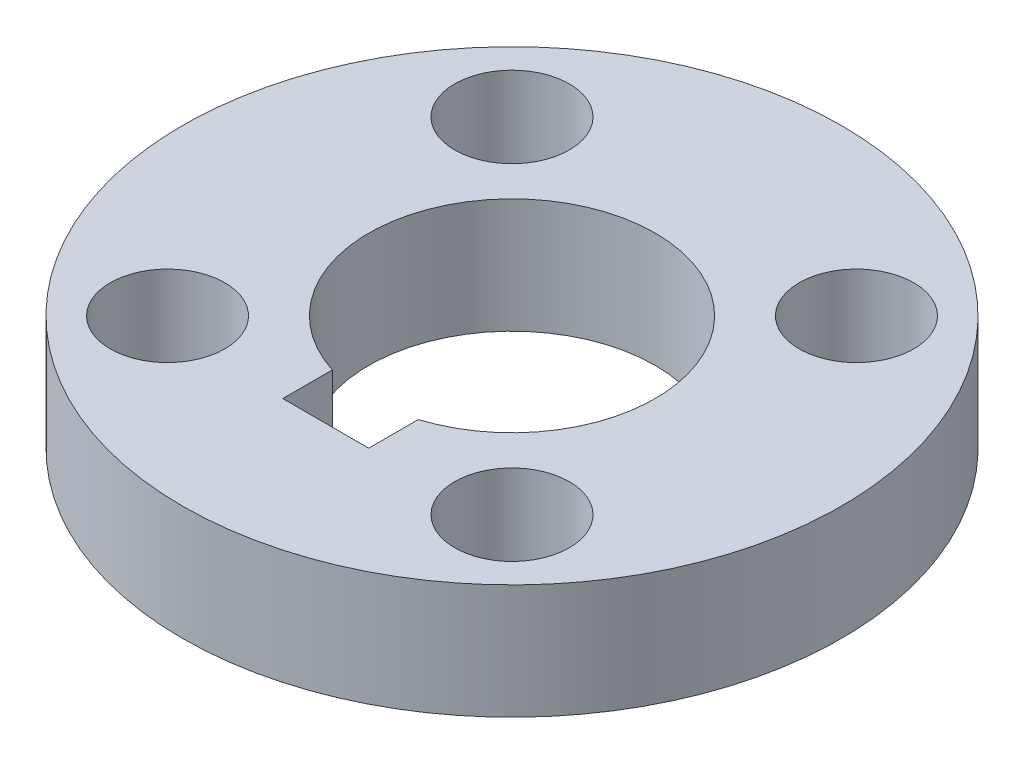
ISO-10303-21;
HEADER;
FILE_DESCRIPTION(('STEP AP214'),'2;1');
FILE_NAME('part.step','',(''),(''),'','','');
FILE_SCHEMA(('AUTOMOTIVE_DESIGN { 1 0 10303 214 1 1 1 1 }'));
ENDSEC;
DATA;
#1=APPLICATION_CONTEXT('core data for automotive mechanical design processes');
#2=APPLICATION_PROTOCOL_DEFINITION('international standard','automotive_design',2000,#1);
#3=PRODUCT_CONTEXT('',#1,'mechanical');
#4=PRODUCT('Part','Part','',(#3));
#5=PRODUCT_RELATED_PRODUCT_CATEGORY('part','',(#4));
#6=PRODUCT_DEFINITION_FORMATION('','',#4);
#7=PRODUCT_DEFINITION_CONTEXT('part definition',#1,'design');
#8=PRODUCT_DEFINITION('design','',#6,#7);
#9=PRODUCT_DEFINITION_SHAPE('','',#8);
#10=(LENGTH_UNIT() NAMED_UNIT(*) SI_UNIT(.MILLI.,.METRE.));
#11=(NAMED_UNIT(*) PLANE_ANGLE_UNIT() SI_UNIT($,.RADIAN.));
#12=(NAMED_UNIT(*) SI_UNIT($,.STERADIAN.) SOLID_ANGLE_UNIT());
#13=UNCERTAINTY_MEASURE_WITH_UNIT(LENGTH_MEASURE(1.E-05),#10,'distance_accuracy_value','');
#14=(GEOMETRIC_REPRESENTATION_CONTEXT(3) GLOBAL_UNCERTAINTY_ASSIGNED_CONTEXT((#13)) GLOBAL_UNIT_ASSIGNED_CONTEXT((#10,
#11,#12)) REPRESENTATION_CONTEXT('',''));
#15=CARTESIAN_POINT('',(0.,0.,0.));
#16=DIRECTION('',(0.,0.,1.));
#17=DIRECTION('',(1.,0.,0.));
#18=AXIS2_PLACEMENT_3D('',#15,#16,#17);
#19=CARTESIAN_POINT('',(0.,8.,0.));
#20=DIRECTION('',(0.,1.,0.));
#21=DIRECTION('',(0.,0.,1.));
#22=AXIS2_PLACEMENT_3D('',#19,#20,#21);
#23=PLANE('',#22);
#24=CARTESIAN_POINT('',(12.0208152801712,8.,-12.0208152801714));
#25=DIRECTION('',(0.,-1.,0.));
#26=DIRECTION('',(-1.,0.,0.));
#27=AXIS2_PLACEMENT_3D('',#24,#25,#26);
#28=CIRCLE('',#27,4.);
#29=CARTESIAN_POINT('',(8.02081528017121,8.,-12.0208152801714));
#30=VERTEX_POINT('',#29);
#31=EDGE_CURVE('E169',#30,#30,#28,.T.);
#32=ORIENTED_EDGE('',*,*,#31,.T.);
#33=EDGE_LOOP('',(#32));
#34=FACE_BOUND('',#33,.T.);
#35=CARTESIAN_POINT('',(-12.0208152801714,8.,-12.0208152801712));
#36=DIRECTION('',(0.,-1.,0.));
#37=DIRECTION('',(0.,0.,1.));
#38=AXIS2_PLACEMENT_3D('',#35,#36,#37);
#39=CIRCLE('',#38,4.);
#40=CARTESIAN_POINT('',(-12.0208152801714,8.,-8.02081528017125));
#41=VERTEX_POINT('',#40);
#42=EDGE_CURVE('E173',#41,#41,#39,.T.);
#43=ORIENTED_EDGE('',*,*,#42,.T.);
#44=EDGE_LOOP('',(#43));
#45=FACE_BOUND('',#44,.T.);
#46=CARTESIAN_POINT('',(-12.0208152801711,8.,12.0208152801715));
#47=DIRECTION('',(0.,-1.,0.));
#48=DIRECTION('',(1.,0.,0.));
#49=AXIS2_PLACEMENT_3D('',#46,#47,#48);
#50=CIRCLE('',#49,4.);
#51=CARTESIAN_POINT('',(-8.02081528017112,8.,12.0208152801715));
#52=VERTEX_POINT('',#51);
#53=EDGE_CURVE('E183',#52,#52,#50,.T.);
#54=ORIENTED_EDGE('',*,*,#53,.T.);
#55=EDGE_LOOP('',(#54));
#56=FACE_BOUND('',#55,.T.);
#57=CARTESIAN_POINT('',(12.0208152801714,8.,12.0208152801712));
#58=DIRECTION('',(0.,-1.,0.));
#59=DIRECTION('',(0.,0.,-1.));
#60=AXIS2_PLACEMENT_3D('',#57,#58,#59);
#61=CIRCLE('',#60,4.);
#62=CARTESIAN_POINT('',(12.0208152801714,8.,8.02081528017125));
#63=VERTEX_POINT('',#62);
#64=EDGE_CURVE('E82',#63,#63,#61,.T.);
#65=ORIENTED_EDGE('',*,*,#64,.T.);
#66=EDGE_LOOP('',(#65));
#67=FACE_BOUND('',#66,.T.);
#68=CARTESIAN_POINT('',(0.,8.,0.));
#69=DIRECTION('',(0.,1.,0.));
#70=DIRECTION('',(0.,0.,1.));
#71=AXIS2_PLACEMENT_3D('',#68,#69,#70);
#72=CIRCLE('',#71,23.);
#73=CARTESIAN_POINT('',(0.,8.,23.));
#74=VERTEX_POINT('',#73);
#75=EDGE_CURVE('E106',#74,#74,#72,.T.);
#76=ORIENTED_EDGE('',*,*,#75,.T.);
#77=EDGE_LOOP('',(#76));
#78=FACE_BOUND('',#77,.T.);
#79=CARTESIAN_POINT('',(0.,8.,0.));
#80=DIRECTION('',(0.,1.,0.));
#81=DIRECTION('',(0.,0.,1.));
#82=AXIS2_PLACEMENT_3D('',#79,#80,#81);
#83=CIRCLE('',#82,10.);
#84=CARTESIAN_POINT('',(3.,8.,9.53939201416946));
#85=VERTEX_POINT('',#84);
#86=CARTESIAN_POINT('',(-3.,8.,9.53939201416946));
#87=VERTEX_POINT('',#86);
#88=EDGE_CURVE('E101',#85,#87,#83,.T.);
#89=ORIENTED_EDGE('',*,*,#88,.F.);
#90=DIRECTION('',(0.,0.,1.));
#91=VECTOR('',#90,1.);
#92=CARTESIAN_POINT('',(3.,8.,0.));
#93=LINE('',#92,#91);
#94=CARTESIAN_POINT('',(3.,8.,13.));
#95=VERTEX_POINT('',#94);
#96=EDGE_CURVE('E57',#85,#95,#93,.T.);
#97=ORIENTED_EDGE('',*,*,#96,.T.);
#98=DIRECTION('',(1.,0.,0.));
#99=VECTOR('',#98,1.);
#100=CARTESIAN_POINT('',(0.,8.,13.));
#101=LINE('',#100,#99);
#102=CARTESIAN_POINT('',(-3.,8.,13.));
#103=VERTEX_POINT('',#102);
#104=EDGE_CURVE('E80',#103,#95,#101,.T.);
#105=ORIENTED_EDGE('',*,*,#104,.F.);
#106=DIRECTION('',(0.,0.,-1.));
#107=VECTOR('',#106,1.);
#108=CARTESIAN_POINT('',(-3.,8.,0.));
#109=LINE('',#108,#107);
#110=EDGE_CURVE('E90',#103,#87,#109,.T.);
#111=ORIENTED_EDGE('',*,*,#110,.T.);
#112=EDGE_LOOP('',(#89,#97,#105,#111));
#113=FACE_BOUND('',#112,.T.);
#114=ADVANCED_FACE('F34',(#34,#45,#56,#67,#78,#113),#23,.T.);
#115=CARTESIAN_POINT('',(0.,0.,0.));
#116=DIRECTION('',(0.,1.,0.));
#117=DIRECTION('',(0.,0.,1.));
#118=AXIS2_PLACEMENT_3D('',#115,#116,#117);
#119=PLANE('',#118);
#120=CARTESIAN_POINT('',(12.0208152801712,0.,-12.0208152801714));
#121=DIRECTION('',(0.,-1.,0.));
#122=DIRECTION('',(-1.,0.,0.));
#123=AXIS2_PLACEMENT_3D('',#120,#121,#122);
#124=CIRCLE('',#123,4.);
#125=CARTESIAN_POINT('',(8.02081528017121,0.,-12.0208152801714));
#126=VERTEX_POINT('',#125);
#127=EDGE_CURVE('E172',#126,#126,#124,.T.);
#128=ORIENTED_EDGE('',*,*,#127,.F.);
#129=EDGE_LOOP('',(#128));
#130=FACE_BOUND('',#129,.T.);
#131=CARTESIAN_POINT('',(-12.0208152801714,0.,-12.0208152801712));
#132=DIRECTION('',(0.,-1.,0.));
#133=DIRECTION('',(0.,0.,1.));
#134=AXIS2_PLACEMENT_3D('',#131,#132,#133);
#135=CIRCLE('',#134,4.);
#136=CARTESIAN_POINT('',(-12.0208152801714,0.,-8.02081528017125));
#137=VERTEX_POINT('',#136);
#138=EDGE_CURVE('E178',#137,#137,#135,.T.);
#139=ORIENTED_EDGE('',*,*,#138,.F.);
#140=EDGE_LOOP('',(#139));
#141=FACE_BOUND('',#140,.T.);
#142=CARTESIAN_POINT('',(-12.0208152801711,0.,12.0208152801715));
#143=DIRECTION('',(0.,-1.,0.));
#144=DIRECTION('',(1.,0.,0.));
#145=AXIS2_PLACEMENT_3D('',#142,#143,#144);
#146=CIRCLE('',#145,4.);
#147=CARTESIAN_POINT('',(-8.02081528017112,0.,12.0208152801715));
#148=VERTEX_POINT('',#147);
#149=EDGE_CURVE('E186',#148,#148,#146,.T.);
#150=ORIENTED_EDGE('',*,*,#149,.F.);
#151=EDGE_LOOP('',(#150));
#152=FACE_BOUND('',#151,.T.);
#153=CARTESIAN_POINT('',(12.0208152801714,0.,12.0208152801712));
#154=DIRECTION('',(0.,-1.,0.));
#155=DIRECTION('',(0.,0.,-1.));
#156=AXIS2_PLACEMENT_3D('',#153,#154,#155);
#157=CIRCLE('',#156,4.);
#158=CARTESIAN_POINT('',(12.0208152801714,0.,8.02081528017125));
#159=VERTEX_POINT('',#158);
#160=EDGE_CURVE('E175',#159,#159,#157,.T.);
#161=ORIENTED_EDGE('',*,*,#160,.F.);
#162=EDGE_LOOP('',(#161));
#163=FACE_BOUND('',#162,.T.);
#164=CARTESIAN_POINT('',(0.,0.,0.));
#165=DIRECTION('',(0.,1.,0.));
#166=DIRECTION('',(0.,0.,1.));
#167=AXIS2_PLACEMENT_3D('',#164,#165,#166);
#168=CIRCLE('',#167,23.);
#169=CARTESIAN_POINT('',(0.,0.,23.));
#170=VERTEX_POINT('',#169);
#171=EDGE_CURVE('E104',#170,#170,#168,.T.);
#172=ORIENTED_EDGE('',*,*,#171,.F.);
#173=EDGE_LOOP('',(#172));
#174=FACE_BOUND('',#173,.T.);
#175=DIRECTION('',(0.,0.,-1.));
#176=VECTOR('',#175,1.);
#177=CARTESIAN_POINT('',(3.,0.,13.));
#178=LINE('',#177,#176);
#179=CARTESIAN_POINT('',(3.,0.,13.));
#180=VERTEX_POINT('',#179);
#181=CARTESIAN_POINT('',(3.,0.,9.53939201416946));
#182=VERTEX_POINT('',#181);
#183=EDGE_CURVE('E85',#180,#182,#178,.T.);
#184=ORIENTED_EDGE('',*,*,#183,.T.);
#185=CARTESIAN_POINT('',(0.,0.,0.));
#186=DIRECTION('',(0.,1.,0.));
#187=DIRECTION('',(0.,0.,1.));
#188=AXIS2_PLACEMENT_3D('',#185,#186,#187);
#189=CIRCLE('',#188,10.);
#190=CARTESIAN_POINT('',(-3.,0.,9.53939201416946));
#191=VERTEX_POINT('',#190);
#192=EDGE_CURVE('E93',#182,#191,#189,.T.);
#193=ORIENTED_EDGE('',*,*,#192,.T.);
#194=DIRECTION('',(0.,0.,-1.));
#195=VECTOR('',#194,1.);
#196=CARTESIAN_POINT('',(-3.,0.,13.));
#197=LINE('',#196,#195);
#198=CARTESIAN_POINT('',(-3.,0.,13.));
#199=VERTEX_POINT('',#198);
#200=EDGE_CURVE('E49',#199,#191,#197,.T.);
#201=ORIENTED_EDGE('',*,*,#200,.F.);
#202=DIRECTION('',(1.,0.,0.));
#203=VECTOR('',#202,1.);
#204=CARTESIAN_POINT('',(0.,0.,13.));
#205=LINE('',#204,#203);
#206=EDGE_CURVE('E11',#199,#180,#205,.T.);
#207=ORIENTED_EDGE('',*,*,#206,.T.);
#208=EDGE_LOOP('',(#184,#193,#201,#207));
#209=FACE_BOUND('',#208,.T.);
#210=ADVANCED_FACE('F92',(#130,#141,#152,#163,#174,#209),#119,.F.);
#211=CARTESIAN_POINT('',(0.,8.,0.));
#212=DIRECTION('',(0.,-1.,0.));
#213=DIRECTION('',(0.,0.,-1.));
#214=AXIS2_PLACEMENT_3D('',#211,#212,#213);
#215=CYLINDRICAL_SURFACE('',#214,10.);
#216=ORIENTED_EDGE('',*,*,#192,.F.);
#217=DIRECTION('',(0.,-1.,0.));
#218=VECTOR('',#217,1.);
#219=CARTESIAN_POINT('',(3.,8.,9.53939201416946));
#220=LINE('',#219,#218);
#221=EDGE_CURVE('E42',#182,#85,#220,.F.);
#222=ORIENTED_EDGE('',*,*,#221,.T.);
#223=ORIENTED_EDGE('',*,*,#88,.T.);
#224=DIRECTION('',(0.,-1.,0.));
#225=VECTOR('',#224,1.);
#226=CARTESIAN_POINT('',(-3.,8.,9.53939201416946));
#227=LINE('',#226,#225);
#228=EDGE_CURVE('E109',#87,#191,#227,.T.);
#229=ORIENTED_EDGE('',*,*,#228,.T.);
#230=EDGE_LOOP('',(#216,#222,#223,#229));
#231=FACE_BOUND('',#230,.T.);
#232=ADVANCED_FACE('F114',(#231),#215,.F.);
#233=CARTESIAN_POINT('',(0.,8.,0.));
#234=DIRECTION('',(0.,-1.,0.));
#235=DIRECTION('',(0.,0.,-1.));
#236=AXIS2_PLACEMENT_3D('',#233,#234,#235);
#237=CYLINDRICAL_SURFACE('',#236,23.);
#238=ORIENTED_EDGE('',*,*,#75,.F.);
#239=EDGE_LOOP('',(#238));
#240=FACE_BOUND('',#239,.T.);
#241=ORIENTED_EDGE('',*,*,#171,.T.);
#242=EDGE_LOOP('',(#241));
#243=FACE_BOUND('',#242,.T.);
#244=ADVANCED_FACE('F36',(#240,#243),#237,.T.);
#245=CARTESIAN_POINT('',(0.,0.,13.));
#246=DIRECTION('',(0.,0.,1.));
#247=DIRECTION('',(1.,0.,0.));
#248=AXIS2_PLACEMENT_3D('',#245,#246,#247);
#249=PLANE('',#248);
#250=ORIENTED_EDGE('',*,*,#104,.T.);
#251=DIRECTION('',(0.,1.,0.));
#252=VECTOR('',#251,1.);
#253=CARTESIAN_POINT('',(3.,0.,13.));
#254=LINE('',#253,#252);
#255=EDGE_CURVE('E75',#180,#95,#254,.T.);
#256=ORIENTED_EDGE('',*,*,#255,.F.);
#257=ORIENTED_EDGE('',*,*,#206,.F.);
#258=DIRECTION('',(0.,-1.,0.));
#259=VECTOR('',#258,1.);
#260=CARTESIAN_POINT('',(-3.,0.,13.));
#261=LINE('',#260,#259);
#262=EDGE_CURVE('E81',#103,#199,#261,.T.);
#263=ORIENTED_EDGE('',*,*,#262,.F.);
#264=EDGE_LOOP('',(#250,#256,#257,#263));
#265=FACE_BOUND('',#264,.T.);
#266=ADVANCED_FACE('F77',(#265),#249,.F.);
#267=CARTESIAN_POINT('',(3.,0.,13.));
#268=DIRECTION('',(-1.,0.,0.));
#269=DIRECTION('',(0.,-1.,0.));
#270=AXIS2_PLACEMENT_3D('',#267,#268,#269);
#271=PLANE('',#270);
#272=ORIENTED_EDGE('',*,*,#221,.F.);
#273=ORIENTED_EDGE('',*,*,#183,.F.);
#274=ORIENTED_EDGE('',*,*,#255,.T.);
#275=ORIENTED_EDGE('',*,*,#96,.F.);
#276=EDGE_LOOP('',(#272,#273,#274,#275));
#277=FACE_BOUND('',#276,.T.);
#278=ADVANCED_FACE('F86',(#277),#271,.T.);
#279=CARTESIAN_POINT('',(-3.,0.,13.));
#280=DIRECTION('',(1.,0.,0.));
#281=DIRECTION('',(0.,1.,0.));
#282=AXIS2_PLACEMENT_3D('',#279,#280,#281);
#283=PLANE('',#282);
#284=ORIENTED_EDGE('',*,*,#262,.T.);
#285=ORIENTED_EDGE('',*,*,#200,.T.);
#286=ORIENTED_EDGE('',*,*,#228,.F.);
#287=ORIENTED_EDGE('',*,*,#110,.F.);
#288=EDGE_LOOP('',(#284,#285,#286,#287));
#289=FACE_BOUND('',#288,.T.);
#290=ADVANCED_FACE('F116',(#289),#283,.T.);
#291=CARTESIAN_POINT('',(12.0208152801714,8.,12.0208152801712));
#292=DIRECTION('',(0.,-1.,0.));
#293=DIRECTION('',(0.,0.,-1.));
#294=AXIS2_PLACEMENT_3D('',#291,#292,#293);
#295=CYLINDRICAL_SURFACE('',#294,4.);
#296=ORIENTED_EDGE('',*,*,#64,.F.);
#297=EDGE_LOOP('',(#296));
#298=FACE_BOUND('',#297,.T.);
#299=ORIENTED_EDGE('',*,*,#160,.T.);
#300=EDGE_LOOP('',(#299));
#301=FACE_BOUND('',#300,.T.);
#302=ADVANCED_FACE('F118',(#298,#301),#295,.F.);
#303=CARTESIAN_POINT('',(-12.0208152801711,8.,12.0208152801715));
#304=DIRECTION('',(0.,-1.,0.));
#305=DIRECTION('',(0.,0.,-1.));
#306=AXIS2_PLACEMENT_3D('',#303,#304,#305);
#307=CYLINDRICAL_SURFACE('',#306,4.);
#308=ORIENTED_EDGE('',*,*,#53,.F.);
#309=EDGE_LOOP('',(#308));
#310=FACE_BOUND('',#309,.T.);
#311=ORIENTED_EDGE('',*,*,#149,.T.);
#312=EDGE_LOOP('',(#311));
#313=FACE_BOUND('',#312,.T.);
#314=ADVANCED_FACE('F124',(#310,#313),#307,.F.);
#315=CARTESIAN_POINT('',(-12.0208152801714,8.,-12.0208152801712));
#316=DIRECTION('',(0.,-1.,0.));
#317=DIRECTION('',(0.,0.,-1.));
#318=AXIS2_PLACEMENT_3D('',#315,#316,#317);
#319=CYLINDRICAL_SURFACE('',#318,4.);
#320=ORIENTED_EDGE('',*,*,#42,.F.);
#321=EDGE_LOOP('',(#320));
#322=FACE_BOUND('',#321,.T.);
#323=ORIENTED_EDGE('',*,*,#138,.T.);
#324=EDGE_LOOP('',(#323));
#325=FACE_BOUND('',#324,.T.);
#326=ADVANCED_FACE('F157',(#322,#325),#319,.F.);
#327=CARTESIAN_POINT('',(12.0208152801712,8.,-12.0208152801714));
#328=DIRECTION('',(0.,-1.,0.));
#329=DIRECTION('',(0.,0.,-1.));
#330=AXIS2_PLACEMENT_3D('',#327,#328,#329);
#331=CYLINDRICAL_SURFACE('',#330,4.);
#332=ORIENTED_EDGE('',*,*,#31,.F.);
#333=EDGE_LOOP('',(#332));
#334=FACE_BOUND('',#333,.T.);
#335=ORIENTED_EDGE('',*,*,#127,.T.);
#336=EDGE_LOOP('',(#335));
#337=FACE_BOUND('',#336,.T.);
#338=ADVANCED_FACE('F161',(#334,#337),#331,.F.);
#339=CLOSED_SHELL('',(#114,#210,#232,#244,#266,#278,#290,#302,#314,#326,#338));
#340=MANIFOLD_SOLID_BREP('B2',#339);
#341=ADVANCED_BREP_SHAPE_REPRESENTATION('',(#18,#340),#14);
#342=SHAPE_DEFINITION_REPRESENTATION(#9,#341);
ENDSEC;
END-ISO-10303-21;
